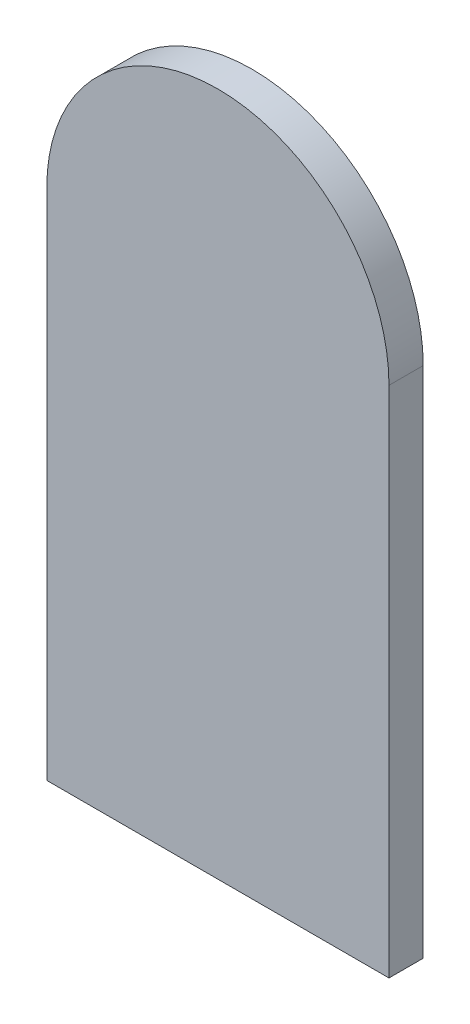
ISO-10303-21;
HEADER;
FILE_DESCRIPTION(('STEP AP214'),'2;1');
FILE_NAME('part.step','',(''),(''),'','','');
FILE_SCHEMA(('AUTOMOTIVE_DESIGN { 1 0 10303 214 1 1 1 1 }'));
ENDSEC;
DATA;
#1=APPLICATION_CONTEXT('core data for automotive mechanical design processes');
#2=APPLICATION_PROTOCOL_DEFINITION('international standard','automotive_design',2000,#1);
#3=PRODUCT_CONTEXT('',#1,'mechanical');
#4=PRODUCT('Part','Part','',(#3));
#5=PRODUCT_RELATED_PRODUCT_CATEGORY('part','',(#4));
#6=PRODUCT_DEFINITION_FORMATION('','',#4);
#7=PRODUCT_DEFINITION_CONTEXT('part definition',#1,'design');
#8=PRODUCT_DEFINITION('design','',#6,#7);
#9=PRODUCT_DEFINITION_SHAPE('','',#8);
#10=(LENGTH_UNIT() NAMED_UNIT(*) SI_UNIT(.MILLI.,.METRE.));
#11=(NAMED_UNIT(*) PLANE_ANGLE_UNIT() SI_UNIT($,.RADIAN.));
#12=(NAMED_UNIT(*) SI_UNIT($,.STERADIAN.) SOLID_ANGLE_UNIT());
#13=UNCERTAINTY_MEASURE_WITH_UNIT(LENGTH_MEASURE(1.E-05),#10,'distance_accuracy_value','');
#14=(GEOMETRIC_REPRESENTATION_CONTEXT(3) GLOBAL_UNCERTAINTY_ASSIGNED_CONTEXT((#13)) GLOBAL_UNIT_ASSIGNED_CONTEXT((#10,
#11,#12)) REPRESENTATION_CONTEXT('',''));
#15=CARTESIAN_POINT('',(0.,0.,0.));
#16=DIRECTION('',(0.,0.,1.));
#17=DIRECTION('',(1.,0.,0.));
#18=AXIS2_PLACEMENT_3D('',#15,#16,#17);
#19=CARTESIAN_POINT('',(10.,0.,2.));
#20=DIRECTION('',(0.,-1.,0.));
#21=DIRECTION('',(1.,0.,0.));
#22=AXIS2_PLACEMENT_3D('',#19,#20,#21);
#23=PLANE('',#22);
#24=DIRECTION('',(-1.,0.,0.));
#25=VECTOR('',#24,1.);
#26=CARTESIAN_POINT('',(10.,0.,0.));
#27=LINE('',#26,#25);
#28=CARTESIAN_POINT('',(10.,0.,0.));
#29=VERTEX_POINT('',#28);
#30=CARTESIAN_POINT('',(-10.,0.,0.));
#31=VERTEX_POINT('',#30);
#32=EDGE_CURVE('E97',#29,#31,#27,.T.);
#33=ORIENTED_EDGE('',*,*,#32,.F.);
#34=DIRECTION('',(0.,0.,-1.));
#35=VECTOR('',#34,1.);
#36=CARTESIAN_POINT('',(10.,0.,2.));
#37=LINE('',#36,#35);
#38=CARTESIAN_POINT('',(10.,0.,2.));
#39=VERTEX_POINT('',#38);
#40=EDGE_CURVE('E11',#39,#29,#37,.T.);
#41=ORIENTED_EDGE('',*,*,#40,.F.);
#42=DIRECTION('',(-1.,0.,0.));
#43=VECTOR('',#42,1.);
#44=CARTESIAN_POINT('',(10.,0.,2.));
#45=LINE('',#44,#43);
#46=CARTESIAN_POINT('',(-10.,0.,2.));
#47=VERTEX_POINT('',#46);
#48=EDGE_CURVE('E91',#39,#47,#45,.T.);
#49=ORIENTED_EDGE('',*,*,#48,.T.);
#50=DIRECTION('',(0.,0.,-1.));
#51=VECTOR('',#50,1.);
#52=CARTESIAN_POINT('',(-10.,0.,2.));
#53=LINE('',#52,#51);
#54=EDGE_CURVE('E36',#47,#31,#53,.T.);
#55=ORIENTED_EDGE('',*,*,#54,.T.);
#56=EDGE_LOOP('',(#33,#41,#49,#55));
#57=FACE_BOUND('',#56,.T.);
#58=ADVANCED_FACE('F33',(#57),#23,.T.);
#59=CARTESIAN_POINT('',(9.99999999999998,30.,2.));
#60=DIRECTION('',(1.,0.,0.));
#61=DIRECTION('',(0.,1.,0.));
#62=AXIS2_PLACEMENT_3D('',#59,#60,#61);
#63=PLANE('',#62);
#64=DIRECTION('',(0.,-1.,0.));
#65=VECTOR('',#64,1.);
#66=CARTESIAN_POINT('',(9.99999999999998,30.,0.));
#67=LINE('',#66,#65);
#68=CARTESIAN_POINT('',(9.99999999999999,30.,0.));
#69=VERTEX_POINT('',#68);
#70=EDGE_CURVE('E93',#69,#29,#67,.T.);
#71=ORIENTED_EDGE('',*,*,#70,.F.);
#72=DIRECTION('',(0.,0.,-1.));
#73=VECTOR('',#72,1.);
#74=CARTESIAN_POINT('',(9.99999999999999,30.,2.));
#75=LINE('',#74,#73);
#76=CARTESIAN_POINT('',(9.99999999999999,30.,2.));
#77=VERTEX_POINT('',#76);
#78=EDGE_CURVE('E42',#77,#69,#75,.T.);
#79=ORIENTED_EDGE('',*,*,#78,.F.);
#80=DIRECTION('',(0.,-1.,0.));
#81=VECTOR('',#80,1.);
#82=CARTESIAN_POINT('',(9.99999999999998,30.,2.));
#83=LINE('',#82,#81);
#84=EDGE_CURVE('E88',#77,#39,#83,.T.);
#85=ORIENTED_EDGE('',*,*,#84,.T.);
#86=ORIENTED_EDGE('',*,*,#40,.T.);
#87=EDGE_LOOP('',(#71,#79,#85,#86));
#88=FACE_BOUND('',#87,.T.);
#89=ADVANCED_FACE('F107',(#88),#63,.T.);
#90=CARTESIAN_POINT('',(0.,30.,2.));
#91=DIRECTION('',(0.,0.,-1.));
#92=DIRECTION('',(-1.,0.,0.));
#93=AXIS2_PLACEMENT_3D('',#90,#91,#92);
#94=CYLINDRICAL_SURFACE('',#93,9.99999999999999);
#95=CARTESIAN_POINT('',(0.,30.,0.));
#96=DIRECTION('',(0.,0.,-1.));
#97=DIRECTION('',(-1.,0.,0.));
#98=AXIS2_PLACEMENT_3D('',#95,#96,#97);
#99=CIRCLE('',#98,9.99999999999999);
#100=CARTESIAN_POINT('',(-10.,30.,0.));
#101=VERTEX_POINT('',#100);
#102=EDGE_CURVE('E83',#101,#69,#99,.T.);
#103=ORIENTED_EDGE('',*,*,#102,.F.);
#104=DIRECTION('',(0.,0.,-1.));
#105=VECTOR('',#104,1.);
#106=CARTESIAN_POINT('',(-10.,30.,2.));
#107=LINE('',#106,#105);
#108=CARTESIAN_POINT('',(-10.,30.,2.));
#109=VERTEX_POINT('',#108);
#110=EDGE_CURVE('E78',#109,#101,#107,.T.);
#111=ORIENTED_EDGE('',*,*,#110,.F.);
#112=CARTESIAN_POINT('',(0.,30.,2.));
#113=DIRECTION('',(0.,0.,-1.));
#114=DIRECTION('',(-1.,0.,0.));
#115=AXIS2_PLACEMENT_3D('',#112,#113,#114);
#116=CIRCLE('',#115,9.99999999999999);
#117=EDGE_CURVE('E81',#109,#77,#116,.T.);
#118=ORIENTED_EDGE('',*,*,#117,.T.);
#119=ORIENTED_EDGE('',*,*,#78,.T.);
#120=EDGE_LOOP('',(#103,#111,#118,#119));
#121=FACE_BOUND('',#120,.T.);
#122=ADVANCED_FACE('F80',(#121),#94,.T.);
#123=CARTESIAN_POINT('',(-10.,0.,2.));
#124=DIRECTION('',(-1.,0.,0.));
#125=DIRECTION('',(0.,0.,1.));
#126=AXIS2_PLACEMENT_3D('',#123,#124,#125);
#127=PLANE('',#126);
#128=DIRECTION('',(0.,1.,0.));
#129=VECTOR('',#128,1.);
#130=CARTESIAN_POINT('',(-10.,0.,0.));
#131=LINE('',#130,#129);
#132=EDGE_CURVE('E100',#31,#101,#131,.T.);
#133=ORIENTED_EDGE('',*,*,#132,.F.);
#134=ORIENTED_EDGE('',*,*,#54,.F.);
#135=DIRECTION('',(0.,1.,0.));
#136=VECTOR('',#135,1.);
#137=CARTESIAN_POINT('',(-10.,0.,2.));
#138=LINE('',#137,#136);
#139=EDGE_CURVE('E87',#47,#109,#138,.T.);
#140=ORIENTED_EDGE('',*,*,#139,.T.);
#141=ORIENTED_EDGE('',*,*,#110,.T.);
#142=EDGE_LOOP('',(#133,#134,#140,#141));
#143=FACE_BOUND('',#142,.T.);
#144=ADVANCED_FACE('F90',(#143),#127,.T.);
#145=CARTESIAN_POINT('',(0.,30.,2.));
#146=DIRECTION('',(0.,0.,-1.));
#147=DIRECTION('',(-1.,0.,0.));
#148=AXIS2_PLACEMENT_3D('',#145,#146,#147);
#149=PLANE('',#148);
#150=ORIENTED_EDGE('',*,*,#48,.F.);
#151=ORIENTED_EDGE('',*,*,#84,.F.);
#152=ORIENTED_EDGE('',*,*,#117,.F.);
#153=ORIENTED_EDGE('',*,*,#139,.F.);
#154=EDGE_LOOP('',(#150,#151,#152,#153));
#155=FACE_BOUND('',#154,.T.);
#156=ADVANCED_FACE('F86',(#155),#149,.F.);
#157=CARTESIAN_POINT('',(0.,30.,0.));
#158=DIRECTION('',(0.,0.,-1.));
#159=DIRECTION('',(-1.,0.,0.));
#160=AXIS2_PLACEMENT_3D('',#157,#158,#159);
#161=PLANE('',#160);
#162=ORIENTED_EDGE('',*,*,#32,.T.);
#163=ORIENTED_EDGE('',*,*,#132,.T.);
#164=ORIENTED_EDGE('',*,*,#102,.T.);
#165=ORIENTED_EDGE('',*,*,#70,.T.);
#166=EDGE_LOOP('',(#162,#163,#164,#165));
#167=FACE_BOUND('',#166,.T.);
#168=ADVANCED_FACE('F106',(#167),#161,.T.);
#169=CLOSED_SHELL('',(#58,#89,#122,#144,#156,#168));
#170=MANIFOLD_SOLID_BREP('B2',#169);
#171=ADVANCED_BREP_SHAPE_REPRESENTATION('',(#18,#170),#14);
#172=SHAPE_DEFINITION_REPRESENTATION(#9,#171);
ENDSEC;
END-ISO-10303-21;
